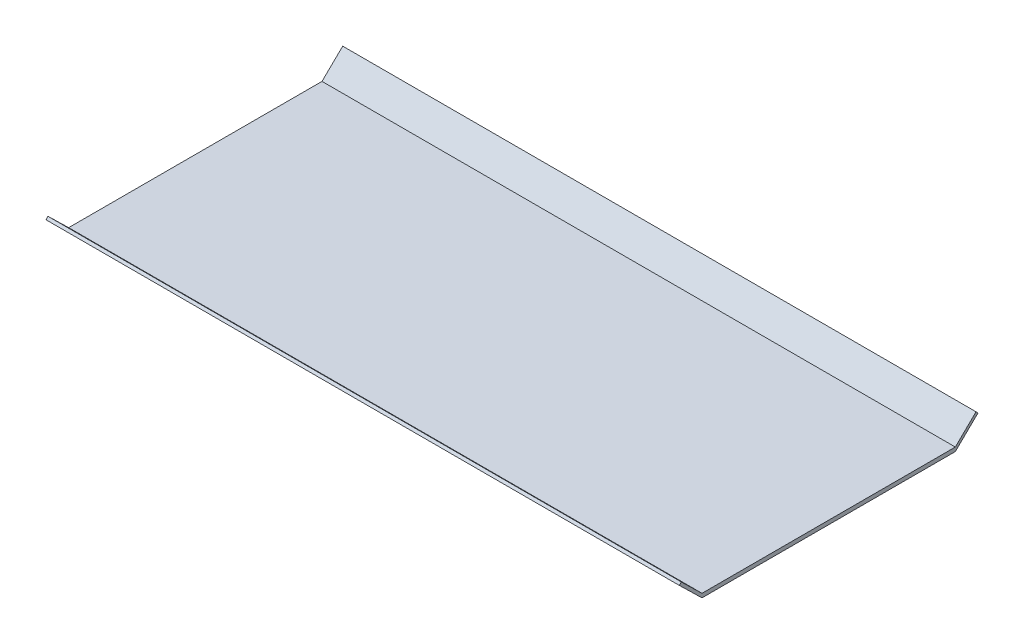
ISO-10303-21;
HEADER;
FILE_DESCRIPTION(('STEP AP214'),'2;1');
FILE_NAME('part.step','',(''),(''),'','','');
FILE_SCHEMA(('AUTOMOTIVE_DESIGN { 1 0 10303 214 1 1 1 1 }'));
ENDSEC;
DATA;
#1=APPLICATION_CONTEXT('core data for automotive mechanical design processes');
#2=APPLICATION_PROTOCOL_DEFINITION('international standard','automotive_design',2000,#1);
#3=PRODUCT_CONTEXT('',#1,'mechanical');
#4=PRODUCT('Part','Part','',(#3));
#5=PRODUCT_RELATED_PRODUCT_CATEGORY('part','',(#4));
#6=PRODUCT_DEFINITION_FORMATION('','',#4);
#7=PRODUCT_DEFINITION_CONTEXT('part definition',#1,'design');
#8=PRODUCT_DEFINITION('design','',#6,#7);
#9=PRODUCT_DEFINITION_SHAPE('','',#8);
#10=(LENGTH_UNIT() NAMED_UNIT(*) SI_UNIT(.MILLI.,.METRE.));
#11=(NAMED_UNIT(*) PLANE_ANGLE_UNIT() SI_UNIT($,.RADIAN.));
#12=(NAMED_UNIT(*) SI_UNIT($,.STERADIAN.) SOLID_ANGLE_UNIT());
#13=UNCERTAINTY_MEASURE_WITH_UNIT(LENGTH_MEASURE(1.E-05),#10,'distance_accuracy_value','');
#14=(GEOMETRIC_REPRESENTATION_CONTEXT(3) GLOBAL_UNCERTAINTY_ASSIGNED_CONTEXT((#13)) GLOBAL_UNIT_ASSIGNED_CONTEXT((#10,
#11,#12)) REPRESENTATION_CONTEXT('',''));
#15=CARTESIAN_POINT('',(0.,0.,0.));
#16=DIRECTION('',(0.,0.,1.));
#17=DIRECTION('',(1.,0.,0.));
#18=AXIS2_PLACEMENT_3D('',#15,#16,#17);
#19=CARTESIAN_POINT('',(0.,6.35,0.));
#20=DIRECTION('',(1.,0.,0.));
#21=DIRECTION('',(0.,0.,-1.));
#22=AXIS2_PLACEMENT_3D('',#19,#20,#21);
#23=PLANE('',#22);
#24=DIRECTION('',(0.,0.,1.));
#25=VECTOR('',#24,1.);
#26=CARTESIAN_POINT('',(0.,0.,0.));
#27=LINE('',#26,#25);
#28=CARTESIAN_POINT('',(0.,0.,-406.4));
#29=VERTEX_POINT('',#28);
#30=CARTESIAN_POINT('',(0.,0.,0.));
#31=VERTEX_POINT('',#30);
#32=EDGE_CURVE('E98',#29,#31,#27,.T.);
#33=ORIENTED_EDGE('',*,*,#32,.T.);
#34=DIRECTION('',(0.,-0.697989146772894,-0.716108337465252));
#35=VECTOR('',#34,1.);
#36=CARTESIAN_POINT('',(0.,0.,0.));
#37=LINE('',#36,#35);
#38=CARTESIAN_POINT('',(0.,35.457848656063,36.3783035432348));
#39=VERTEX_POINT('',#38);
#40=EDGE_CURVE('E113',#39,#31,#37,.T.);
#41=ORIENTED_EDGE('',*,*,#40,.F.);
#42=DIRECTION('',(0.,-0.716108337465252,0.697989146772894));
#43=VECTOR('',#42,1.);
#44=CARTESIAN_POINT('',(0.,35.457848656063,36.3783035432348));
#45=LINE('',#44,#43);
#46=CARTESIAN_POINT('',(0.,38.714199464832,33.2043459118363));
#47=VERTEX_POINT('',#46);
#48=EDGE_CURVE('E110',#47,#39,#45,.T.);
#49=ORIENTED_EDGE('',*,*,#48,.F.);
#50=DIRECTION('',(0.,0.697989146772894,0.716108337465252));
#51=VECTOR('',#50,1.);
#52=CARTESIAN_POINT('',(0.,38.714199464832,33.2043459118363));
#53=LINE('',#52,#51);
#54=CARTESIAN_POINT('',(0.,6.35,0.));
#55=VERTEX_POINT('',#54);
#56=EDGE_CURVE('E108',#55,#47,#53,.T.);
#57=ORIENTED_EDGE('',*,*,#56,.F.);
#58=DIRECTION('',(0.,0.,1.));
#59=VECTOR('',#58,1.);
#60=CARTESIAN_POINT('',(0.,6.35,0.));
#61=LINE('',#60,#59);
#62=CARTESIAN_POINT('',(0.,6.35,-406.4));
#63=VERTEX_POINT('',#62);
#64=EDGE_CURVE('E84',#63,#55,#61,.T.);
#65=ORIENTED_EDGE('',*,*,#64,.F.);
#66=DIRECTION('',(0.,-0.697989146772894,0.716108337465252));
#67=VECTOR('',#66,1.);
#68=CARTESIAN_POINT('',(0.,38.714199464832,-439.604345911836));
#69=LINE('',#68,#67);
#70=CARTESIAN_POINT('',(0.,38.714199464832,-439.604345911836));
#71=VERTEX_POINT('',#70);
#72=EDGE_CURVE('E142',#71,#63,#69,.T.);
#73=ORIENTED_EDGE('',*,*,#72,.F.);
#74=DIRECTION('',(0.,0.716108337465249,0.697989146772897));
#75=VECTOR('',#74,1.);
#76=CARTESIAN_POINT('',(0.,35.457848656063,-442.778303543235));
#77=LINE('',#76,#75);
#78=CARTESIAN_POINT('',(0.,35.457848656063,-442.778303543235));
#79=VERTEX_POINT('',#78);
#80=EDGE_CURVE('E141',#79,#71,#77,.T.);
#81=ORIENTED_EDGE('',*,*,#80,.F.);
#82=DIRECTION('',(0.,0.697989146772894,-0.716108337465252));
#83=VECTOR('',#82,1.);
#84=CARTESIAN_POINT('',(0.,0.,-406.4));
#85=LINE('',#84,#83);
#86=EDGE_CURVE('E134',#29,#79,#85,.T.);
#87=ORIENTED_EDGE('',*,*,#86,.F.);
#88=EDGE_LOOP('',(#33,#41,#49,#57,#65,#73,#81,#87));
#89=FACE_BOUND('',#88,.T.);
#90=ADVANCED_FACE('F34',(#89),#23,.F.);
#91=CARTESIAN_POINT('',(1016.,6.35,0.));
#92=DIRECTION('',(-1.,0.,0.));
#93=DIRECTION('',(0.,0.,1.));
#94=AXIS2_PLACEMENT_3D('',#91,#92,#93);
#95=PLANE('',#94);
#96=DIRECTION('',(0.,0.,-1.));
#97=VECTOR('',#96,1.);
#98=CARTESIAN_POINT('',(1016.,0.,0.));
#99=LINE('',#98,#97);
#100=CARTESIAN_POINT('',(1016.,0.,0.));
#101=VERTEX_POINT('',#100);
#102=CARTESIAN_POINT('',(1016.,0.,-406.4));
#103=VERTEX_POINT('',#102);
#104=EDGE_CURVE('E62',#101,#103,#99,.T.);
#105=ORIENTED_EDGE('',*,*,#104,.T.);
#106=DIRECTION('',(0.,-0.697989146772894,0.716108337465252));
#107=VECTOR('',#106,1.);
#108=CARTESIAN_POINT('',(1016.,0.,-406.4));
#109=LINE('',#108,#107);
#110=CARTESIAN_POINT('',(1016.,35.457848656063,-442.778303543235));
#111=VERTEX_POINT('',#110);
#112=EDGE_CURVE('E136',#111,#103,#109,.T.);
#113=ORIENTED_EDGE('',*,*,#112,.F.);
#114=DIRECTION('',(0.,-0.71610833746525,-0.697989146772897));
#115=VECTOR('',#114,1.);
#116=CARTESIAN_POINT('',(1016.,35.457848656063,-442.778303543235));
#117=LINE('',#116,#115);
#118=CARTESIAN_POINT('',(1016.,38.714199464832,-439.604345911836));
#119=VERTEX_POINT('',#118);
#120=EDGE_CURVE('E154',#119,#111,#117,.T.);
#121=ORIENTED_EDGE('',*,*,#120,.F.);
#122=DIRECTION('',(0.,0.697989146772894,-0.716108337465252));
#123=VECTOR('',#122,1.);
#124=CARTESIAN_POINT('',(1016.,38.714199464832,-439.604345911836));
#125=LINE('',#124,#123);
#126=CARTESIAN_POINT('',(1016.,6.35,-406.4));
#127=VERTEX_POINT('',#126);
#128=EDGE_CURVE('E92',#127,#119,#125,.T.);
#129=ORIENTED_EDGE('',*,*,#128,.F.);
#130=DIRECTION('',(0.,0.,-1.));
#131=VECTOR('',#130,1.);
#132=CARTESIAN_POINT('',(1016.,6.35,0.));
#133=LINE('',#132,#131);
#134=CARTESIAN_POINT('',(1016.,6.35,0.));
#135=VERTEX_POINT('',#134);
#136=EDGE_CURVE('E43',#135,#127,#133,.T.);
#137=ORIENTED_EDGE('',*,*,#136,.F.);
#138=DIRECTION('',(0.,-0.697989146772894,-0.716108337465252));
#139=VECTOR('',#138,1.);
#140=CARTESIAN_POINT('',(1016.,38.714199464832,33.2043459118363));
#141=LINE('',#140,#139);
#142=CARTESIAN_POINT('',(1016.,38.714199464832,33.2043459118363));
#143=VERTEX_POINT('',#142);
#144=EDGE_CURVE('E73',#143,#135,#141,.T.);
#145=ORIENTED_EDGE('',*,*,#144,.F.);
#146=DIRECTION('',(0.,0.716108337465252,-0.697989146772894));
#147=VECTOR('',#146,1.);
#148=CARTESIAN_POINT('',(1016.,35.457848656063,36.3783035432348));
#149=LINE('',#148,#147);
#150=CARTESIAN_POINT('',(1016.,35.457848656063,36.3783035432348));
#151=VERTEX_POINT('',#150);
#152=EDGE_CURVE('E99',#151,#143,#149,.T.);
#153=ORIENTED_EDGE('',*,*,#152,.F.);
#154=DIRECTION('',(0.,0.697989146772894,0.716108337465252));
#155=VECTOR('',#154,1.);
#156=CARTESIAN_POINT('',(1016.,0.,0.));
#157=LINE('',#156,#155);
#158=EDGE_CURVE('E104',#101,#151,#157,.T.);
#159=ORIENTED_EDGE('',*,*,#158,.F.);
#160=EDGE_LOOP('',(#105,#113,#121,#129,#137,#145,#153,#159));
#161=FACE_BOUND('',#160,.T.);
#162=ADVANCED_FACE('F89',(#161),#95,.F.);
#163=CARTESIAN_POINT('',(0.,6.35,0.));
#164=DIRECTION('',(0.,-1.,0.));
#165=DIRECTION('',(0.,0.,-1.));
#166=AXIS2_PLACEMENT_3D('',#163,#164,#165);
#167=PLANE('',#166);
#168=ORIENTED_EDGE('',*,*,#64,.T.);
#169=DIRECTION('',(1.,0.,0.));
#170=VECTOR('',#169,1.);
#171=CARTESIAN_POINT('',(0.,6.35,0.));
#172=LINE('',#171,#170);
#173=EDGE_CURVE('E81',#55,#135,#172,.T.);
#174=ORIENTED_EDGE('',*,*,#173,.T.);
#175=ORIENTED_EDGE('',*,*,#136,.T.);
#176=DIRECTION('',(-1.,0.,0.));
#177=VECTOR('',#176,1.);
#178=CARTESIAN_POINT('',(0.,6.35,-406.4));
#179=LINE('',#178,#177);
#180=EDGE_CURVE('E11',#127,#63,#179,.T.);
#181=ORIENTED_EDGE('',*,*,#180,.T.);
#182=EDGE_LOOP('',(#168,#174,#175,#181));
#183=FACE_BOUND('',#182,.T.);
#184=ADVANCED_FACE('F82',(#183),#167,.F.);
#185=CARTESIAN_POINT('',(0.,0.,0.));
#186=DIRECTION('',(0.,-1.,0.));
#187=DIRECTION('',(0.,0.,-1.));
#188=AXIS2_PLACEMENT_3D('',#185,#186,#187);
#189=PLANE('',#188);
#190=ORIENTED_EDGE('',*,*,#32,.F.);
#191=DIRECTION('',(-1.,0.,0.));
#192=VECTOR('',#191,1.);
#193=CARTESIAN_POINT('',(0.,0.,-406.4));
#194=LINE('',#193,#192);
#195=EDGE_CURVE('E37',#103,#29,#194,.T.);
#196=ORIENTED_EDGE('',*,*,#195,.F.);
#197=ORIENTED_EDGE('',*,*,#104,.F.);
#198=DIRECTION('',(1.,0.,0.));
#199=VECTOR('',#198,1.);
#200=CARTESIAN_POINT('',(0.,0.,0.));
#201=LINE('',#200,#199);
#202=EDGE_CURVE('E102',#31,#101,#201,.T.);
#203=ORIENTED_EDGE('',*,*,#202,.F.);
#204=EDGE_LOOP('',(#190,#196,#197,#203));
#205=FACE_BOUND('',#204,.T.);
#206=ADVANCED_FACE('F187',(#205),#189,.T.);
#207=CARTESIAN_POINT('',(1069.1241019584,0.,0.));
#208=DIRECTION('',(0.,0.716108337465252,-0.697989146772894));
#209=DIRECTION('',(0.,0.697989146772894,0.716108337465252));
#210=AXIS2_PLACEMENT_3D('',#207,#208,#209);
#211=PLANE('',#210);
#212=ORIENTED_EDGE('',*,*,#202,.T.);
#213=ORIENTED_EDGE('',*,*,#158,.T.);
#214=DIRECTION('',(-1.,0.,0.));
#215=VECTOR('',#214,1.);
#216=CARTESIAN_POINT('',(1069.1241019584,35.457848656063,36.3783035432348));
#217=LINE('',#216,#215);
#218=EDGE_CURVE('E116',#151,#39,#217,.T.);
#219=ORIENTED_EDGE('',*,*,#218,.T.);
#220=ORIENTED_EDGE('',*,*,#40,.T.);
#221=EDGE_LOOP('',(#212,#213,#219,#220));
#222=FACE_BOUND('',#221,.T.);
#223=ADVANCED_FACE('F178',(#222),#211,.F.);
#224=CARTESIAN_POINT('',(1069.1241019584,35.457848656063,36.3783035432348));
#225=DIRECTION('',(0.,-0.697989146772894,-0.716108337465252));
#226=DIRECTION('',(0.,0.716108337465252,-0.697989146772894));
#227=AXIS2_PLACEMENT_3D('',#224,#225,#226);
#228=PLANE('',#227);
#229=ORIENTED_EDGE('',*,*,#218,.F.);
#230=ORIENTED_EDGE('',*,*,#152,.T.);
#231=DIRECTION('',(-1.,0.,0.));
#232=VECTOR('',#231,1.);
#233=CARTESIAN_POINT('',(1069.1241019584,38.714199464832,33.2043459118363));
#234=LINE('',#233,#232);
#235=EDGE_CURVE('E96',#143,#47,#234,.T.);
#236=ORIENTED_EDGE('',*,*,#235,.T.);
#237=ORIENTED_EDGE('',*,*,#48,.T.);
#238=EDGE_LOOP('',(#229,#230,#236,#237));
#239=FACE_BOUND('',#238,.T.);
#240=ADVANCED_FACE('F179',(#239),#228,.F.);
#241=CARTESIAN_POINT('',(1069.1241019584,38.714199464832,33.2043459118363));
#242=DIRECTION('',(0.,-0.716108337465252,0.697989146772894));
#243=DIRECTION('',(0.,-0.697989146772894,-0.716108337465252));
#244=AXIS2_PLACEMENT_3D('',#241,#242,#243);
#245=PLANE('',#244);
#246=ORIENTED_EDGE('',*,*,#235,.F.);
#247=ORIENTED_EDGE('',*,*,#144,.T.);
#248=ORIENTED_EDGE('',*,*,#173,.F.);
#249=ORIENTED_EDGE('',*,*,#56,.T.);
#250=EDGE_LOOP('',(#246,#247,#248,#249));
#251=FACE_BOUND('',#250,.T.);
#252=ADVANCED_FACE('F94',(#251),#245,.F.);
#253=CARTESIAN_POINT('',(1069.1241019584,35.457848656063,-442.778303543235));
#254=DIRECTION('',(0.,-0.697989146772897,0.716108337465249));
#255=DIRECTION('',(0.,-0.71610833746525,-0.697989146772897));
#256=AXIS2_PLACEMENT_3D('',#253,#254,#255);
#257=PLANE('',#256);
#258=DIRECTION('',(-1.,0.,0.));
#259=VECTOR('',#258,1.);
#260=CARTESIAN_POINT('',(1069.1241019584,38.714199464832,-439.604345911836));
#261=LINE('',#260,#259);
#262=EDGE_CURVE('E144',#119,#71,#261,.T.);
#263=ORIENTED_EDGE('',*,*,#262,.F.);
#264=ORIENTED_EDGE('',*,*,#120,.T.);
#265=DIRECTION('',(-1.,0.,0.));
#266=VECTOR('',#265,1.);
#267=CARTESIAN_POINT('',(1069.1241019584,35.457848656063,-442.778303543235));
#268=LINE('',#267,#266);
#269=EDGE_CURVE('E152',#111,#79,#268,.T.);
#270=ORIENTED_EDGE('',*,*,#269,.T.);
#271=ORIENTED_EDGE('',*,*,#80,.T.);
#272=EDGE_LOOP('',(#263,#264,#270,#271));
#273=FACE_BOUND('',#272,.T.);
#274=ADVANCED_FACE('F165',(#273),#257,.F.);
#275=CARTESIAN_POINT('',(1069.1241019584,0.,-406.4));
#276=DIRECTION('',(0.,0.716108337465252,0.697989146772894));
#277=DIRECTION('',(0.,-0.697989146772894,0.716108337465252));
#278=AXIS2_PLACEMENT_3D('',#275,#276,#277);
#279=PLANE('',#278);
#280=ORIENTED_EDGE('',*,*,#269,.F.);
#281=ORIENTED_EDGE('',*,*,#112,.T.);
#282=ORIENTED_EDGE('',*,*,#195,.T.);
#283=ORIENTED_EDGE('',*,*,#86,.T.);
#284=EDGE_LOOP('',(#280,#281,#282,#283));
#285=FACE_BOUND('',#284,.T.);
#286=ADVANCED_FACE('F132',(#285),#279,.F.);
#287=CARTESIAN_POINT('',(1069.1241019584,38.714199464832,-439.604345911836));
#288=DIRECTION('',(0.,-0.716108337465252,-0.697989146772894));
#289=DIRECTION('',(0.,0.697989146772894,-0.716108337465252));
#290=AXIS2_PLACEMENT_3D('',#287,#288,#289);
#291=PLANE('',#290);
#292=ORIENTED_EDGE('',*,*,#180,.F.);
#293=ORIENTED_EDGE('',*,*,#128,.T.);
#294=ORIENTED_EDGE('',*,*,#262,.T.);
#295=ORIENTED_EDGE('',*,*,#72,.T.);
#296=EDGE_LOOP('',(#292,#293,#294,#295));
#297=FACE_BOUND('',#296,.T.);
#298=ADVANCED_FACE('F162',(#297),#291,.F.);
#299=CLOSED_SHELL('',(#90,#162,#184,#206,#223,#240,#252,#274,#286,#298));
#300=MANIFOLD_SOLID_BREP('B2',#299);
#301=ADVANCED_BREP_SHAPE_REPRESENTATION('',(#18,#300),#14);
#302=SHAPE_DEFINITION_REPRESENTATION(#9,#301);
ENDSEC;
END-ISO-10303-21;
